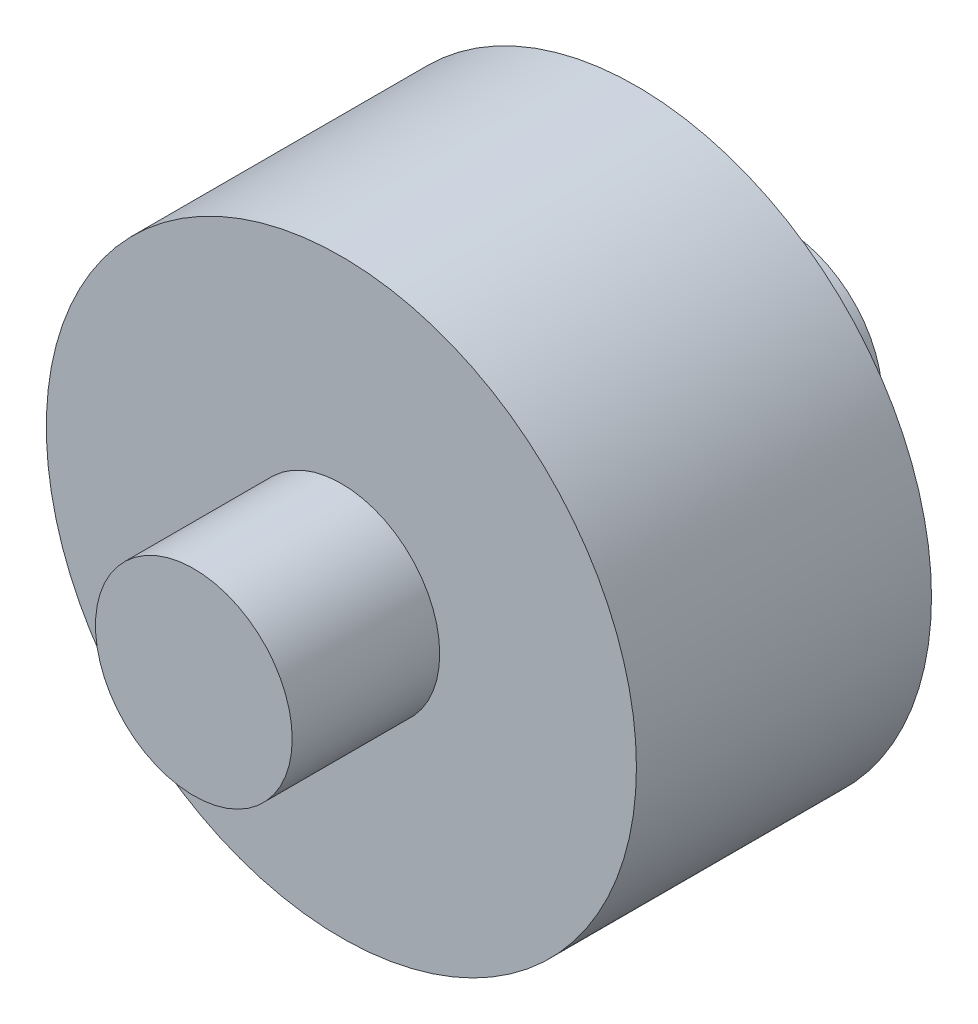
ISO-10303-21;
HEADER;
FILE_DESCRIPTION(('STEP AP214'),'2;1');
FILE_NAME('part.step','',(''),(''),'','','');
FILE_SCHEMA(('AUTOMOTIVE_DESIGN { 1 0 10303 214 1 1 1 1 }'));
ENDSEC;
DATA;
#1=APPLICATION_CONTEXT('core data for automotive mechanical design processes');
#2=APPLICATION_PROTOCOL_DEFINITION('international standard','automotive_design',2000,#1);
#3=PRODUCT_CONTEXT('',#1,'mechanical');
#4=PRODUCT('Part','Part','',(#3));
#5=PRODUCT_RELATED_PRODUCT_CATEGORY('part','',(#4));
#6=PRODUCT_DEFINITION_FORMATION('','',#4);
#7=PRODUCT_DEFINITION_CONTEXT('part definition',#1,'design');
#8=PRODUCT_DEFINITION('design','',#6,#7);
#9=PRODUCT_DEFINITION_SHAPE('','',#8);
#10=(LENGTH_UNIT() NAMED_UNIT(*) SI_UNIT(.MILLI.,.METRE.));
#11=(NAMED_UNIT(*) PLANE_ANGLE_UNIT() SI_UNIT($,.RADIAN.));
#12=(NAMED_UNIT(*) SI_UNIT($,.STERADIAN.) SOLID_ANGLE_UNIT());
#13=UNCERTAINTY_MEASURE_WITH_UNIT(LENGTH_MEASURE(1.E-05),#10,'distance_accuracy_value','');
#14=(GEOMETRIC_REPRESENTATION_CONTEXT(3) GLOBAL_UNCERTAINTY_ASSIGNED_CONTEXT((#13)) GLOBAL_UNIT_ASSIGNED_CONTEXT((#10,
#11,#12)) REPRESENTATION_CONTEXT('',''));
#15=CARTESIAN_POINT('',(0.,0.,0.));
#16=DIRECTION('',(0.,0.,1.));
#17=DIRECTION('',(1.,0.,0.));
#18=AXIS2_PLACEMENT_3D('',#15,#16,#17);
#19=CARTESIAN_POINT('',(0.,0.,4.7625));
#20=DIRECTION('',(0.,0.,-1.));
#21=DIRECTION('',(-1.,0.,0.));
#22=AXIS2_PLACEMENT_3D('',#19,#20,#21);
#23=CYLINDRICAL_SURFACE('',#22,9.525);
#24=CARTESIAN_POINT('',(-9.525,0.,-3.175));
#25=CARTESIAN_POINT('',(-9.52500048580498,0.173238677165346,-3.17500080559796));
#26=CARTESIAN_POINT('',(-9.52023018186455,0.346472492659896,-3.16077515504609));
#27=CARTESIAN_POINT('',(-9.50167042395416,0.687837590771687,-3.10442257950533));
#28=CARTESIAN_POINT('',(-9.48788003366834,0.855968341777246,-3.06229275796217));
#29=CARTESIAN_POINT('',(-9.45277852602955,1.18215660666814,-2.95173640225565));
#30=CARTESIAN_POINT('',(-9.43147998545459,1.34023044718816,-2.88335382669181));
#31=CARTESIAN_POINT('',(-9.3835361515256,1.64266542435691,-2.72243177623825));
#32=CARTESIAN_POINT('',(-9.35688980370195,1.78702384834389,-2.62988753611674));
#33=CARTESIAN_POINT('',(-9.30002249856541,2.0629298181957,-2.41990306957346));
#34=CARTESIAN_POINT('',(-9.26971591772517,2.19393674844713,-2.30177583122293));
#35=CARTESIAN_POINT('',(-9.2094149943641,2.43469379932912,-2.04543928380665));
#36=CARTESIAN_POINT('',(-9.17942072197493,2.54443923892904,-1.90722556410197));
#37=CARTESIAN_POINT('',(-9.12219830615344,2.74264419157345,-1.60977225925124));
#38=CARTESIAN_POINT('',(-9.0950744970031,2.83040092485178,-1.45004237635051));
#39=CARTESIAN_POINT('',(-9.04796594704058,2.97757492456177,-1.11704090009411));
#40=CARTESIAN_POINT('',(-9.02797902810367,3.03700083920298,-0.943773458008288));
#41=CARTESIAN_POINT('',(-8.99830887880273,3.12379824029159,-0.594762521747945));
#42=CARTESIAN_POINT('',(-8.98830104068516,3.15218269826287,-0.41929936304722));
#43=CARTESIAN_POINT('',(-8.97876209798686,3.17925806658696,-0.065837580555078));
#44=CARTESIAN_POINT('',(-8.97922775597168,3.17795815259498,0.11216024275168));
#45=CARTESIAN_POINT('',(-8.99029872650972,3.14648819425835,0.456998801659767));
#46=CARTESIAN_POINT('',(-9.00043970379417,3.11764017430521,0.623977679267884));
#47=CARTESIAN_POINT('',(-9.02895888275449,3.0340495670469,0.9505741072517));
#48=CARTESIAN_POINT('',(-9.04733807064542,2.97930387942919,1.11019077375635));
#49=CARTESIAN_POINT('',(-9.09059367841715,2.84460650934117,1.42053547995295));
#50=CARTESIAN_POINT('',(-9.11556996393148,2.76426310464556,1.57107898086574));
#51=CARTESIAN_POINT('',(-9.16916373477931,2.58092291251247,1.85696513378813));
#52=CARTESIAN_POINT('',(-9.19778227084722,2.47791958175572,1.99230337801349));
#53=CARTESIAN_POINT('',(-9.25726270107577,2.2458341312661,2.25136582416045));
#54=CARTESIAN_POINT('',(-9.28816371201626,2.11567125149229,2.3741148050663));
#55=CARTESIAN_POINT('',(-9.34742029378842,1.83622813465495,2.59629677165629));
#56=CARTESIAN_POINT('',(-9.37577562033364,1.68694606622309,2.69572752117227));
#57=CARTESIAN_POINT('',(-9.42711817702495,1.3714336714219,2.86923575324634));
#58=CARTESIAN_POINT('',(-9.45004936275525,1.20504990262187,2.94305193500682));
#59=CARTESIAN_POINT('',(-9.4875530068358,0.86127933968231,3.06134507730938));
#60=CARTESIAN_POINT('',(-9.50212836854242,0.683896391141976,3.10583222946941));
#61=CARTESIAN_POINT('',(-9.52079715951823,0.331418658755539,3.16247673962099));
#62=CARTESIAN_POINT('',(-9.52531755822087,0.156557979570885,3.17595189412348));
#63=CARTESIAN_POINT('',(-9.52464766056077,-0.192960847123755,3.17394376132486));
#64=CARTESIAN_POINT('',(-9.51945900331475,-0.367619023839891,3.15846536206389));
#65=CARTESIAN_POINT('',(-9.50023578476806,-0.706500575516013,3.10003219293833));
#66=CARTESIAN_POINT('',(-9.48646180908036,-0.870879661700629,3.05788629579285));
#67=CARTESIAN_POINT('',(-9.45171613685472,-1.19016766849015,2.94832581381814));
#68=CARTESIAN_POINT('',(-9.43074352248193,-1.34507537851483,2.88090800668978));
#69=CARTESIAN_POINT('',(-9.38304356837145,-1.64556534104864,2.7207513789055));
#70=CARTESIAN_POINT('',(-9.35617936849621,-1.79079512051444,2.62739316632593));
#71=CARTESIAN_POINT('',(-9.29974181184133,-2.06395583568049,2.41873357370719));
#72=CARTESIAN_POINT('',(-9.27016762910402,-2.19188146775096,2.30342549209915));
#73=CARTESIAN_POINT('',(-9.20993992337912,-2.432851712285,2.04794246555408));
#74=CARTESIAN_POINT('',(-9.17929841452584,-2.54495607735532,1.90687570450722));
#75=CARTESIAN_POINT('',(-9.121774152107,-2.74401763337735,1.60727527220043));
#76=CARTESIAN_POINT('',(-9.09489142987857,-2.83097461468097,1.44874145533681));
#77=CARTESIAN_POINT('',(-9.04819093937643,-2.97687025407195,1.11863817645458));
#78=CARTESIAN_POINT('',(-9.02835890517708,-3.03586556962394,0.947095898639168));
#79=CARTESIAN_POINT('',(-8.99829392572977,-3.12386556696095,0.595697786109885));
#80=CARTESIAN_POINT('',(-8.98805665630055,-3.15288375947876,0.41584573484119));
#81=CARTESIAN_POINT('',(-8.97883201925513,-3.17905219686556,0.0628742200700907));
#82=CARTESIAN_POINT('',(-8.97929370817293,-3.17776306695417,-0.110116430410664));
#83=CARTESIAN_POINT('',(-8.99005281690779,-3.1471942816996,-0.453279112877548));
#84=CARTESIAN_POINT('',(-9.00034965132723,-3.11791629228101,-0.623451312007406));
#85=CARTESIAN_POINT('',(-9.02920864668031,-3.03330550668567,-0.95293073003285));
#86=CARTESIAN_POINT('',(-9.04761011221366,-2.97847812359926,-1.11238291938928));
#87=CARTESIAN_POINT('',(-9.09054566248638,-2.8447344862872,-1.419947017029));
#88=CARTESIAN_POINT('',(-9.11508110823773,-2.76581288515833,-1.56805639902192));
#89=CARTESIAN_POINT('',(-9.16885482792697,-2.58210269895239,-1.85573565200524));
#90=CARTESIAN_POINT('',(-9.19825159463785,-2.47633567077754,-1.99465089352738));
#91=CARTESIAN_POINT('',(-9.25777156199328,-2.24359115395568,-2.25326515749484));
#92=CARTESIAN_POINT('',(-9.28789496596782,-2.11660766813345,-2.37295872780964));
#93=CARTESIAN_POINT('',(-9.34688346918603,-1.83909194322318,-2.59443350901814));
#94=CARTESIAN_POINT('',(-9.3756537721899,-1.68783480536164,-2.69533480410942));
#95=CARTESIAN_POINT('',(-9.42740021973043,-1.36955960976603,-2.8701696116008));
#96=CARTESIAN_POINT('',(-9.45037784507677,-1.20254559507021,-2.94411001830248));
#97=CARTESIAN_POINT('',(-9.4870751034262,-0.865167329863098,-3.05981618315153));
#98=CARTESIAN_POINT('',(-9.50116249441509,-0.695286130622598,-3.10287183038622));
#99=CARTESIAN_POINT('',(-9.52012342428904,-0.350267320832534,-3.16045939114988));
#100=CARTESIAN_POINT('',(-9.52499950888798,-0.17513117618077,-3.1749991856015));
#101=CARTESIAN_POINT('',(-9.525,0.,-3.175));
#102=B_SPLINE_CURVE_WITH_KNOTS('',3,(#24,#25,#26,#27,#28,#29,#30,#31,#32,#33,#34,#35,#36,#37,
#38,#39,#40,#41,#42,#43,#44,#45,#46,#47,#48,#49,#50,#51,#52,#53,#54,#55,#56,#57,#58,#59,#60,#61,
#62,#63,#64,#65,#66,#67,#68,#69,#70,#71,#72,#73,#74,#75,#76,#77,#78,#79,#80,#81,#82,#83,#84,#85,
#86,#87,#88,#89,#90,#91,#92,#93,#94,#95,#96,#97,#98,#99,#100,#101),.UNSPECIFIED.,.T.,.F.,(4,2,2,
2,2,2,2,2,2,2,2,2,2,2,2,2,2,2,2,2,2,2,2,2,2,2,2,2,2,2,2,2,2,2,2,2,2,2,4),(0.,0.519071561632585,
1.03819701322438,1.55645698636312,2.07481924951214,2.6093637259775,3.14402575687908,
3.69406121814519,4.24392866899746,4.77526114230342,5.30642937910266,5.81332424300315,
6.32027980466155,6.8353994341754,7.35066800622308,7.8928374595109,8.43505888444013,
8.98265937939885,9.53006948685136,10.0537512658116,10.5773446429626,11.0857715158083,
11.5942632377703,12.1161301950386,12.638156741095,13.1839024764639,13.7296527614611,
14.274292439,14.8186865394104,15.3351123975402,15.8515075194062,16.3580948898033,
16.8647947620873,17.3936046174648,17.92256420318,18.4721392315144,19.0215736265905,
19.5464607283686,20.0712027467109),.UNSPECIFIED.);
#103=CARTESIAN_POINT('',(-9.525,0.,-3.175));
#104=VERTEX_POINT('',#103);
#105=EDGE_CURVE('E10',#104,#104,#102,.T.);
#106=ORIENTED_EDGE('',*,*,#105,.T.);
#107=EDGE_LOOP('',(#106));
#108=FACE_BOUND('',#107,.T.);
#109=CARTESIAN_POINT('',(0.,0.,4.7625));
#110=DIRECTION('',(0.,0.,1.));
#111=DIRECTION('',(1.,0.,0.));
#112=AXIS2_PLACEMENT_3D('',#109,#110,#111);
#113=CIRCLE('',#112,9.525);
#114=CARTESIAN_POINT('',(9.525,0.,4.7625));
#115=VERTEX_POINT('',#114);
#116=EDGE_CURVE('E54',#115,#115,#113,.T.);
#117=ORIENTED_EDGE('',*,*,#116,.F.);
#118=EDGE_LOOP('',(#117));
#119=FACE_BOUND('',#118,.T.);
#120=CARTESIAN_POINT('',(0.,0.,-4.7625));
#121=DIRECTION('',(0.,0.,1.));
#122=DIRECTION('',(1.,0.,0.));
#123=AXIS2_PLACEMENT_3D('',#120,#121,#122);
#124=CIRCLE('',#123,9.525);
#125=CARTESIAN_POINT('',(9.525,0.,-4.7625));
#126=VERTEX_POINT('',#125);
#127=EDGE_CURVE('E59',#126,#126,#124,.T.);
#128=ORIENTED_EDGE('',*,*,#127,.T.);
#129=EDGE_LOOP('',(#128));
#130=FACE_BOUND('',#129,.T.);
#131=ADVANCED_FACE('F37',(#108,#119,#130),#23,.T.);
#132=CARTESIAN_POINT('',(0.,0.,4.7625));
#133=DIRECTION('',(0.,0.,1.));
#134=DIRECTION('',(1.,0.,0.));
#135=AXIS2_PLACEMENT_3D('',#132,#133,#134);
#136=PLANE('',#135);
#137=CARTESIAN_POINT('',(0.,0.,4.7625));
#138=DIRECTION('',(0.,0.,1.));
#139=DIRECTION('',(1.,0.,0.));
#140=AXIS2_PLACEMENT_3D('',#137,#138,#139);
#141=CIRCLE('',#140,3.175);
#142=CARTESIAN_POINT('',(3.175,0.,4.7625));
#143=VERTEX_POINT('',#142);
#144=EDGE_CURVE('E64',#143,#143,#141,.F.);
#145=ORIENTED_EDGE('',*,*,#144,.T.);
#146=EDGE_LOOP('',(#145));
#147=FACE_BOUND('',#146,.T.);
#148=ORIENTED_EDGE('',*,*,#116,.T.);
#149=EDGE_LOOP('',(#148));
#150=FACE_BOUND('',#149,.T.);
#151=ADVANCED_FACE('F93',(#147,#150),#136,.T.);
#152=CARTESIAN_POINT('',(0.,0.,-4.7625));
#153=DIRECTION('',(0.,0.,1.));
#154=DIRECTION('',(1.,0.,0.));
#155=AXIS2_PLACEMENT_3D('',#152,#153,#154);
#156=PLANE('',#155);
#157=CARTESIAN_POINT('',(0.,0.,-4.7625));
#158=DIRECTION('',(0.,0.,1.));
#159=DIRECTION('',(1.,0.,0.));
#160=AXIS2_PLACEMENT_3D('',#157,#158,#159);
#161=CIRCLE('',#160,3.175);
#162=CARTESIAN_POINT('',(3.175,0.,-4.7625));
#163=VERTEX_POINT('',#162);
#164=EDGE_CURVE('E49',#163,#163,#161,.F.);
#165=ORIENTED_EDGE('',*,*,#164,.F.);
#166=EDGE_LOOP('',(#165));
#167=FACE_BOUND('',#166,.T.);
#168=ORIENTED_EDGE('',*,*,#127,.F.);
#169=EDGE_LOOP('',(#168));
#170=FACE_BOUND('',#169,.T.);
#171=ADVANCED_FACE('F97',(#167,#170),#156,.F.);
#172=CARTESIAN_POINT('',(0.,0.,-9.525));
#173=DIRECTION('',(0.,0.,1.));
#174=DIRECTION('',(1.,0.,0.));
#175=AXIS2_PLACEMENT_3D('',#172,#173,#174);
#176=PLANE('',#175);
#177=CARTESIAN_POINT('',(0.,0.,-9.525));
#178=DIRECTION('',(0.,0.,1.));
#179=DIRECTION('',(1.,0.,0.));
#180=AXIS2_PLACEMENT_3D('',#177,#178,#179);
#181=CIRCLE('',#180,3.175);
#182=CARTESIAN_POINT('',(3.175,0.,-9.525));
#183=VERTEX_POINT('',#182);
#184=EDGE_CURVE('E70',#183,#183,#181,.T.);
#185=ORIENTED_EDGE('',*,*,#184,.F.);
#186=EDGE_LOOP('',(#185));
#187=FACE_BOUND('',#186,.T.);
#188=ADVANCED_FACE('F106',(#187),#176,.F.);
#189=CARTESIAN_POINT('',(0.,0.,9.525));
#190=DIRECTION('',(0.,0.,-1.));
#191=DIRECTION('',(-1.,0.,0.));
#192=AXIS2_PLACEMENT_3D('',#189,#190,#191);
#193=CYLINDRICAL_SURFACE('',#192,3.175);
#194=ORIENTED_EDGE('',*,*,#184,.T.);
#195=EDGE_LOOP('',(#194));
#196=FACE_BOUND('',#195,.T.);
#197=ORIENTED_EDGE('',*,*,#164,.T.);
#198=EDGE_LOOP('',(#197));
#199=FACE_BOUND('',#198,.T.);
#200=ADVANCED_FACE('F111',(#196,#199),#193,.T.);
#201=ORIENTED_EDGE('',*,*,#144,.F.);
#202=EDGE_LOOP('',(#201));
#203=FACE_BOUND('',#202,.T.);
#204=CARTESIAN_POINT('',(0.,0.,9.525));
#205=DIRECTION('',(0.,0.,1.));
#206=DIRECTION('',(1.,0.,0.));
#207=AXIS2_PLACEMENT_3D('',#204,#205,#206);
#208=CIRCLE('',#207,3.175);
#209=CARTESIAN_POINT('',(3.175,0.,9.525));
#210=VERTEX_POINT('',#209);
#211=EDGE_CURVE('E69',#210,#210,#208,.T.);
#212=ORIENTED_EDGE('',*,*,#211,.F.);
#213=EDGE_LOOP('',(#212));
#214=FACE_BOUND('',#213,.T.);
#215=ADVANCED_FACE('F115',(#203,#214),#193,.T.);
#216=CARTESIAN_POINT('',(0.,0.,9.525));
#217=DIRECTION('',(0.,0.,1.));
#218=DIRECTION('',(1.,0.,0.));
#219=AXIS2_PLACEMENT_3D('',#216,#217,#218);
#220=PLANE('',#219);
#221=ORIENTED_EDGE('',*,*,#211,.T.);
#222=EDGE_LOOP('',(#221));
#223=FACE_BOUND('',#222,.T.);
#224=ADVANCED_FACE('F91',(#223),#220,.T.);
#225=CARTESIAN_POINT('',(-9.525,0.,0.));
#226=DIRECTION('',(1.,0.,0.));
#227=DIRECTION('',(0.,0.,-1.));
#228=AXIS2_PLACEMENT_3D('',#225,#226,#227);
#229=CYLINDRICAL_SURFACE('',#228,3.175);
#230=CARTESIAN_POINT('',(0.,0.,0.));
#231=DIRECTION('',(1.,0.,0.));
#232=DIRECTION('',(0.,0.,-1.));
#233=AXIS2_PLACEMENT_3D('',#230,#231,#232);
#234=CIRCLE('',#233,3.175);
#235=CARTESIAN_POINT('',(0.,0.,-3.175));
#236=VERTEX_POINT('',#235);
#237=EDGE_CURVE('E74',#236,#236,#234,.T.);
#238=ORIENTED_EDGE('',*,*,#237,.T.);
#239=EDGE_LOOP('',(#238));
#240=FACE_BOUND('',#239,.T.);
#241=ORIENTED_EDGE('',*,*,#105,.F.);
#242=EDGE_LOOP('',(#241));
#243=FACE_BOUND('',#242,.T.);
#244=ADVANCED_FACE('F82',(#240,#243),#229,.F.);
#245=CARTESIAN_POINT('',(0.,0.,0.));
#246=DIRECTION('',(1.,0.,0.));
#247=DIRECTION('',(0.,0.,-1.));
#248=AXIS2_PLACEMENT_3D('',#245,#246,#247);
#249=PLANE('',#248);
#250=ORIENTED_EDGE('',*,*,#237,.F.);
#251=EDGE_LOOP('',(#250));
#252=FACE_BOUND('',#251,.T.);
#253=ADVANCED_FACE('F85',(#252),#249,.F.);
#254=CLOSED_SHELL('',(#131,#151,#171,#188,#200,#215,#224,#244,#253));
#255=MANIFOLD_SOLID_BREP('B2',#254);
#256=ADVANCED_BREP_SHAPE_REPRESENTATION('',(#18,#255),#14);
#257=SHAPE_DEFINITION_REPRESENTATION(#9,#256);
ENDSEC;
END-ISO-10303-21;
